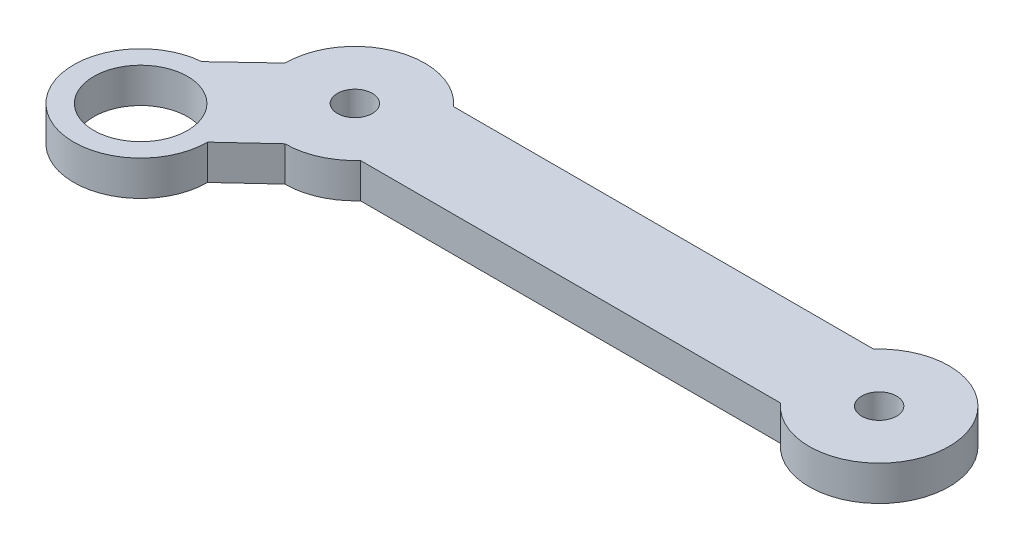
ISO-10303-21;
HEADER;
FILE_DESCRIPTION(('STEP AP214'),'2;1');
FILE_NAME('part.step','',(''),(''),'','','');
FILE_SCHEMA(('AUTOMOTIVE_DESIGN { 1 0 10303 214 1 1 1 1 }'));
ENDSEC;
DATA;
#1=APPLICATION_CONTEXT('core data for automotive mechanical design processes');
#2=APPLICATION_PROTOCOL_DEFINITION('international standard','automotive_design',2000,#1);
#3=PRODUCT_CONTEXT('',#1,'mechanical');
#4=PRODUCT('Part','Part','',(#3));
#5=PRODUCT_RELATED_PRODUCT_CATEGORY('part','',(#4));
#6=PRODUCT_DEFINITION_FORMATION('','',#4);
#7=PRODUCT_DEFINITION_CONTEXT('part definition',#1,'design');
#8=PRODUCT_DEFINITION('design','',#6,#7);
#9=PRODUCT_DEFINITION_SHAPE('','',#8);
#10=(LENGTH_UNIT() NAMED_UNIT(*) SI_UNIT(.MILLI.,.METRE.));
#11=(NAMED_UNIT(*) PLANE_ANGLE_UNIT() SI_UNIT($,.RADIAN.));
#12=(NAMED_UNIT(*) SI_UNIT($,.STERADIAN.) SOLID_ANGLE_UNIT());
#13=UNCERTAINTY_MEASURE_WITH_UNIT(LENGTH_MEASURE(1.E-05),#10,'distance_accuracy_value','');
#14=(GEOMETRIC_REPRESENTATION_CONTEXT(3) GLOBAL_UNCERTAINTY_ASSIGNED_CONTEXT((#13)) GLOBAL_UNIT_ASSIGNED_CONTEXT((#10,
#11,#12)) REPRESENTATION_CONTEXT('',''));
#15=CARTESIAN_POINT('',(0.,0.,0.));
#16=DIRECTION('',(0.,0.,1.));
#17=DIRECTION('',(1.,0.,0.));
#18=AXIS2_PLACEMENT_3D('',#15,#16,#17);
#19=CARTESIAN_POINT('',(-23.9679992587768,3.,-25.45393827542));
#20=DIRECTION('',(-0.685536847864458,0.,-0.728037931855245));
#21=DIRECTION('',(-0.728037931855245,0.,0.685536847864458));
#22=AXIS2_PLACEMENT_3D('',#19,#20,#21);
#23=PLANE('',#22);
#24=DIRECTION('',(0.728037931855245,0.,-0.685536847864458));
#25=VECTOR('',#24,1.);
#26=CARTESIAN_POINT('',(-23.9679992587768,0.,-25.45393827542));
#27=LINE('',#26,#25);
#28=CARTESIAN_POINT('',(-54.6775840073379,0.,3.46289559628114));
#29=VERTEX_POINT('',#28);
#30=CARTESIAN_POINT('',(-51.,0.,0.));
#31=VERTEX_POINT('',#30);
#32=EDGE_CURVE('E138',#29,#31,#27,.T.);
#33=ORIENTED_EDGE('',*,*,#32,.F.);
#34=DIRECTION('',(0.,-1.,0.));
#35=VECTOR('',#34,1.);
#36=CARTESIAN_POINT('',(-54.6775840073379,3.,3.46289559628114));
#37=LINE('',#36,#35);
#38=CARTESIAN_POINT('',(-54.6775840073379,3.,3.46289559628114));
#39=VERTEX_POINT('',#38);
#40=EDGE_CURVE('E11',#39,#29,#37,.T.);
#41=ORIENTED_EDGE('',*,*,#40,.F.);
#42=DIRECTION('',(0.728037931855245,0.,-0.685536847864458));
#43=VECTOR('',#42,1.);
#44=CARTESIAN_POINT('',(-23.9679992587768,3.,-25.45393827542));
#45=LINE('',#44,#43);
#46=CARTESIAN_POINT('',(-51.,3.,0.));
#47=VERTEX_POINT('',#46);
#48=EDGE_CURVE('E162',#39,#47,#45,.T.);
#49=ORIENTED_EDGE('',*,*,#48,.T.);
#50=DIRECTION('',(0.,-1.,0.));
#51=VECTOR('',#50,1.);
#52=CARTESIAN_POINT('',(-51.,3.,0.));
#53=LINE('',#52,#51);
#54=EDGE_CURVE('E83',#47,#31,#53,.T.);
#55=ORIENTED_EDGE('',*,*,#54,.T.);
#56=EDGE_LOOP('',(#33,#41,#49,#55));
#57=FACE_BOUND('',#56,.T.);
#58=ADVANCED_FACE('F33',(#57),#23,.T.);
#59=CARTESIAN_POINT('',(-54.1923881554251,3.,9.19238815542514));
#60=DIRECTION('',(0.,-1.,0.));
#61=DIRECTION('',(0.,0.,-1.));
#62=AXIS2_PLACEMENT_3D('',#59,#60,#61);
#63=CYLINDRICAL_SURFACE('',#62,5.75);
#64=CARTESIAN_POINT('',(-54.1923881554251,0.,9.19238815542514));
#65=DIRECTION('',(0.,1.,0.));
#66=DIRECTION('',(0.,0.,1.));
#67=AXIS2_PLACEMENT_3D('',#64,#65,#66);
#68=CIRCLE('',#67,5.75);
#69=CARTESIAN_POINT('',(-48.4423881554251,0.,9.19238815542515));
#70=VERTEX_POINT('',#69);
#71=EDGE_CURVE('E141',#29,#70,#68,.T.);
#72=ORIENTED_EDGE('',*,*,#71,.T.);
#73=DIRECTION('',(0.,-1.,0.));
#74=VECTOR('',#73,1.);
#75=CARTESIAN_POINT('',(-48.4423881554251,3.,9.19238815542515));
#76=LINE('',#75,#74);
#77=CARTESIAN_POINT('',(-48.4423881554251,3.,9.19238815542515));
#78=VERTEX_POINT('',#77);
#79=EDGE_CURVE('E41',#78,#70,#76,.T.);
#80=ORIENTED_EDGE('',*,*,#79,.F.);
#81=CARTESIAN_POINT('',(-54.1923881554251,3.,9.19238815542514));
#82=DIRECTION('',(0.,1.,0.));
#83=DIRECTION('',(0.,0.,1.));
#84=AXIS2_PLACEMENT_3D('',#81,#82,#83);
#85=CIRCLE('',#84,5.75);
#86=EDGE_CURVE('E194',#39,#78,#85,.T.);
#87=ORIENTED_EDGE('',*,*,#86,.F.);
#88=ORIENTED_EDGE('',*,*,#40,.T.);
#89=EDGE_LOOP('',(#72,#80,#87,#88));
#90=FACE_BOUND('',#89,.T.);
#91=ADVANCED_FACE('F196',(#90),#63,.T.);
#92=CARTESIAN_POINT('',(-17.8152996984545,3.,-19.2104386063108));
#93=DIRECTION('',(-0.679980277016653,0.,-0.73323040230773));
#94=DIRECTION('',(-0.73323040230773,0.,0.679980277016653));
#95=AXIS2_PLACEMENT_3D('',#92,#93,#94);
#96=PLANE('',#95);
#97=DIRECTION('',(0.73323040230773,0.,-0.679980277016653));
#98=VECTOR('',#97,1.);
#99=CARTESIAN_POINT('',(-17.8152996984545,0.,-19.2104386063108));
#100=LINE('',#99,#98);
#101=CARTESIAN_POINT('',(-45.,0.,6.00000000000001));
#102=VERTEX_POINT('',#101);
#103=EDGE_CURVE('E143',#70,#102,#100,.T.);
#104=ORIENTED_EDGE('',*,*,#103,.T.);
#105=DIRECTION('',(0.,-1.,0.));
#106=VECTOR('',#105,1.);
#107=CARTESIAN_POINT('',(-45.,3.,6.00000000000001));
#108=LINE('',#107,#106);
#109=CARTESIAN_POINT('',(-45.,3.,6.00000000000001));
#110=VERTEX_POINT('',#109);
#111=EDGE_CURVE('E169',#110,#102,#108,.T.);
#112=ORIENTED_EDGE('',*,*,#111,.F.);
#113=DIRECTION('',(0.73323040230773,0.,-0.679980277016653));
#114=VECTOR('',#113,1.);
#115=CARTESIAN_POINT('',(-17.8152996984545,3.,-19.2104386063108));
#116=LINE('',#115,#114);
#117=EDGE_CURVE('E178',#78,#110,#116,.T.);
#118=ORIENTED_EDGE('',*,*,#117,.F.);
#119=ORIENTED_EDGE('',*,*,#79,.T.);
#120=EDGE_LOOP('',(#104,#112,#118,#119));
#121=FACE_BOUND('',#120,.T.);
#122=ADVANCED_FACE('F176',(#121),#96,.F.);
#123=CARTESIAN_POINT('',(-45.,3.,0.));
#124=DIRECTION('',(0.,-1.,0.));
#125=DIRECTION('',(0.,0.,-1.));
#126=AXIS2_PLACEMENT_3D('',#123,#124,#125);
#127=CYLINDRICAL_SURFACE('',#126,6.);
#128=CARTESIAN_POINT('',(-45.,0.,0.));
#129=DIRECTION('',(0.,1.,0.));
#130=DIRECTION('',(0.,0.,1.));
#131=AXIS2_PLACEMENT_3D('',#128,#129,#130);
#132=CIRCLE('',#131,6.);
#133=CARTESIAN_POINT('',(-40.5278640450004,0.,4.00000000000001));
#134=VERTEX_POINT('',#133);
#135=EDGE_CURVE('E145',#102,#134,#132,.T.);
#136=ORIENTED_EDGE('',*,*,#135,.T.);
#137=DIRECTION('',(0.,-1.,0.));
#138=VECTOR('',#137,1.);
#139=CARTESIAN_POINT('',(-40.5278640450004,3.,4.00000000000001));
#140=LINE('',#139,#138);
#141=CARTESIAN_POINT('',(-40.5278640450004,3.,4.00000000000001));
#142=VERTEX_POINT('',#141);
#143=EDGE_CURVE('E166',#142,#134,#140,.T.);
#144=ORIENTED_EDGE('',*,*,#143,.F.);
#145=CARTESIAN_POINT('',(-45.,3.,0.));
#146=DIRECTION('',(0.,1.,0.));
#147=DIRECTION('',(0.,0.,1.));
#148=AXIS2_PLACEMENT_3D('',#145,#146,#147);
#149=CIRCLE('',#148,6.);
#150=EDGE_CURVE('E127',#110,#142,#149,.T.);
#151=ORIENTED_EDGE('',*,*,#150,.F.);
#152=ORIENTED_EDGE('',*,*,#111,.T.);
#153=EDGE_LOOP('',(#136,#144,#151,#152));
#154=FACE_BOUND('',#153,.T.);
#155=ADVANCED_FACE('F188',(#154),#127,.T.);
#156=CARTESIAN_POINT('',(0.,3.,4.00000000000001));
#157=DIRECTION('',(0.,0.,-1.));
#158=DIRECTION('',(-1.,0.,0.));
#159=AXIS2_PLACEMENT_3D('',#156,#157,#158);
#160=PLANE('',#159);
#161=DIRECTION('',(1.,0.,0.));
#162=VECTOR('',#161,1.);
#163=CARTESIAN_POINT('',(0.,0.,4.00000000000001));
#164=LINE('',#163,#162);
#165=CARTESIAN_POINT('',(-4.47213595499958,0.,4.00000000000001));
#166=VERTEX_POINT('',#165);
#167=EDGE_CURVE('E147',#134,#166,#164,.T.);
#168=ORIENTED_EDGE('',*,*,#167,.T.);
#169=DIRECTION('',(0.,-1.,0.));
#170=VECTOR('',#169,1.);
#171=CARTESIAN_POINT('',(-4.47213595499958,3.,4.00000000000001));
#172=LINE('',#171,#170);
#173=CARTESIAN_POINT('',(-4.47213595499958,3.,4.00000000000001));
#174=VERTEX_POINT('',#173);
#175=EDGE_CURVE('E121',#174,#166,#172,.T.);
#176=ORIENTED_EDGE('',*,*,#175,.F.);
#177=DIRECTION('',(1.,0.,0.));
#178=VECTOR('',#177,1.);
#179=CARTESIAN_POINT('',(0.,3.,4.00000000000001));
#180=LINE('',#179,#178);
#181=EDGE_CURVE('E108',#142,#174,#180,.T.);
#182=ORIENTED_EDGE('',*,*,#181,.F.);
#183=ORIENTED_EDGE('',*,*,#143,.T.);
#184=EDGE_LOOP('',(#168,#176,#182,#183));
#185=FACE_BOUND('',#184,.T.);
#186=ADVANCED_FACE('F191',(#185),#160,.F.);
#187=CARTESIAN_POINT('',(0.,3.,0.));
#188=DIRECTION('',(0.,-1.,0.));
#189=DIRECTION('',(0.,0.,-1.));
#190=AXIS2_PLACEMENT_3D('',#187,#188,#189);
#191=CYLINDRICAL_SURFACE('',#190,6.);
#192=CARTESIAN_POINT('',(0.,0.,0.));
#193=DIRECTION('',(0.,1.,0.));
#194=DIRECTION('',(0.,0.,1.));
#195=AXIS2_PLACEMENT_3D('',#192,#193,#194);
#196=CIRCLE('',#195,6.);
#197=CARTESIAN_POINT('',(-4.47213595499958,0.,-4.));
#198=VERTEX_POINT('',#197);
#199=EDGE_CURVE('E117',#166,#198,#196,.T.);
#200=ORIENTED_EDGE('',*,*,#199,.T.);
#201=DIRECTION('',(0.,-1.,0.));
#202=VECTOR('',#201,1.);
#203=CARTESIAN_POINT('',(-4.47213595499958,3.,-4.));
#204=LINE('',#203,#202);
#205=CARTESIAN_POINT('',(-4.47213595499958,3.,-4.));
#206=VERTEX_POINT('',#205);
#207=EDGE_CURVE('E114',#206,#198,#204,.T.);
#208=ORIENTED_EDGE('',*,*,#207,.F.);
#209=CARTESIAN_POINT('',(0.,3.,0.));
#210=DIRECTION('',(0.,1.,0.));
#211=DIRECTION('',(0.,0.,1.));
#212=AXIS2_PLACEMENT_3D('',#209,#210,#211);
#213=CIRCLE('',#212,6.);
#214=EDGE_CURVE('E101',#174,#206,#213,.T.);
#215=ORIENTED_EDGE('',*,*,#214,.F.);
#216=ORIENTED_EDGE('',*,*,#175,.T.);
#217=EDGE_LOOP('',(#200,#208,#215,#216));
#218=FACE_BOUND('',#217,.T.);
#219=ADVANCED_FACE('F115',(#218),#191,.T.);
#220=CARTESIAN_POINT('',(0.,3.,-4.));
#221=DIRECTION('',(0.,0.,-1.));
#222=DIRECTION('',(-1.,0.,0.));
#223=AXIS2_PLACEMENT_3D('',#220,#221,#222);
#224=PLANE('',#223);
#225=DIRECTION('',(1.,0.,0.));
#226=VECTOR('',#225,1.);
#227=CARTESIAN_POINT('',(0.,0.,-4.));
#228=LINE('',#227,#226);
#229=CARTESIAN_POINT('',(-40.5278640450004,0.,-4.));
#230=VERTEX_POINT('',#229);
#231=EDGE_CURVE('E151',#230,#198,#228,.T.);
#232=ORIENTED_EDGE('',*,*,#231,.F.);
#233=DIRECTION('',(0.,-1.,0.));
#234=VECTOR('',#233,1.);
#235=CARTESIAN_POINT('',(-40.5278640450004,3.,-4.));
#236=LINE('',#235,#234);
#237=CARTESIAN_POINT('',(-40.5278640450004,3.,-4.));
#238=VERTEX_POINT('',#237);
#239=EDGE_CURVE('E76',#238,#230,#236,.T.);
#240=ORIENTED_EDGE('',*,*,#239,.F.);
#241=DIRECTION('',(1.,0.,0.));
#242=VECTOR('',#241,1.);
#243=CARTESIAN_POINT('',(0.,3.,-4.));
#244=LINE('',#243,#242);
#245=EDGE_CURVE('E106',#238,#206,#244,.T.);
#246=ORIENTED_EDGE('',*,*,#245,.T.);
#247=ORIENTED_EDGE('',*,*,#207,.T.);
#248=EDGE_LOOP('',(#232,#240,#246,#247));
#249=FACE_BOUND('',#248,.T.);
#250=ADVANCED_FACE('F123',(#249),#224,.T.);
#251=CARTESIAN_POINT('',(-45.,3.,0.));
#252=DIRECTION('',(0.,-1.,0.));
#253=DIRECTION('',(0.,0.,-1.));
#254=AXIS2_PLACEMENT_3D('',#251,#252,#253);
#255=CYLINDRICAL_SURFACE('',#254,1.5);
#256=CARTESIAN_POINT('',(-45.,3.,0.));
#257=DIRECTION('',(0.,1.,0.));
#258=DIRECTION('',(0.,0.,1.));
#259=AXIS2_PLACEMENT_3D('',#256,#257,#258);
#260=CIRCLE('',#259,1.5);
#261=CARTESIAN_POINT('',(-45.,3.,1.50000000000001));
#262=VERTEX_POINT('',#261);
#263=EDGE_CURVE('E132',#262,#262,#260,.T.);
#264=ORIENTED_EDGE('',*,*,#263,.T.);
#265=EDGE_LOOP('',(#264));
#266=FACE_BOUND('',#265,.T.);
#267=CARTESIAN_POINT('',(-45.,0.,0.));
#268=DIRECTION('',(0.,1.,0.));
#269=DIRECTION('',(0.,0.,1.));
#270=AXIS2_PLACEMENT_3D('',#267,#268,#269);
#271=CIRCLE('',#270,1.5);
#272=CARTESIAN_POINT('',(-45.,0.,1.50000000000001));
#273=VERTEX_POINT('',#272);
#274=EDGE_CURVE('E156',#273,#273,#271,.T.);
#275=ORIENTED_EDGE('',*,*,#274,.F.);
#276=EDGE_LOOP('',(#275));
#277=FACE_BOUND('',#276,.T.);
#278=ADVANCED_FACE('F210',(#266,#277),#255,.F.);
#279=CARTESIAN_POINT('',(0.,3.,0.));
#280=DIRECTION('',(0.,-1.,0.));
#281=DIRECTION('',(0.,0.,-1.));
#282=AXIS2_PLACEMENT_3D('',#279,#280,#281);
#283=CYLINDRICAL_SURFACE('',#282,1.5);
#284=CARTESIAN_POINT('',(0.,3.,0.));
#285=DIRECTION('',(0.,1.,0.));
#286=DIRECTION('',(0.,0.,1.));
#287=AXIS2_PLACEMENT_3D('',#284,#285,#286);
#288=CIRCLE('',#287,1.5);
#289=CARTESIAN_POINT('',(0.,3.,1.5));
#290=VERTEX_POINT('',#289);
#291=EDGE_CURVE('E125',#290,#290,#288,.T.);
#292=ORIENTED_EDGE('',*,*,#291,.T.);
#293=EDGE_LOOP('',(#292));
#294=FACE_BOUND('',#293,.T.);
#295=CARTESIAN_POINT('',(0.,0.,0.));
#296=DIRECTION('',(0.,1.,0.));
#297=DIRECTION('',(0.,0.,1.));
#298=AXIS2_PLACEMENT_3D('',#295,#296,#297);
#299=CIRCLE('',#298,1.5);
#300=CARTESIAN_POINT('',(0.,0.,1.5));
#301=VERTEX_POINT('',#300);
#302=EDGE_CURVE('E153',#301,#301,#299,.T.);
#303=ORIENTED_EDGE('',*,*,#302,.F.);
#304=EDGE_LOOP('',(#303));
#305=FACE_BOUND('',#304,.T.);
#306=ADVANCED_FACE('F215',(#294,#305),#283,.F.);
#307=EDGE_CURVE('E148',#230,#31,#132,.T.);
#308=ORIENTED_EDGE('',*,*,#307,.T.);
#309=ORIENTED_EDGE('',*,*,#54,.F.);
#310=EDGE_CURVE('E49',#238,#47,#149,.T.);
#311=ORIENTED_EDGE('',*,*,#310,.F.);
#312=ORIENTED_EDGE('',*,*,#239,.T.);
#313=EDGE_LOOP('',(#308,#309,#311,#312));
#314=FACE_BOUND('',#313,.T.);
#315=ADVANCED_FACE('F211',(#314),#127,.T.);
#316=CARTESIAN_POINT('',(-54.1923881554251,3.,9.19238815542514));
#317=DIRECTION('',(0.,-1.,0.));
#318=DIRECTION('',(0.,0.,-1.));
#319=AXIS2_PLACEMENT_3D('',#316,#317,#318);
#320=CYLINDRICAL_SURFACE('',#319,4.024);
#321=CARTESIAN_POINT('',(-54.1923881554251,3.,9.19238815542514));
#322=DIRECTION('',(0.,1.,0.));
#323=DIRECTION('',(0.,0.,1.));
#324=AXIS2_PLACEMENT_3D('',#321,#322,#323);
#325=CIRCLE('',#324,4.024);
#326=CARTESIAN_POINT('',(-54.1923881554251,3.,13.2163881554251));
#327=VERTEX_POINT('',#326);
#328=EDGE_CURVE('E135',#327,#327,#325,.T.);
#329=ORIENTED_EDGE('',*,*,#328,.T.);
#330=EDGE_LOOP('',(#329));
#331=FACE_BOUND('',#330,.T.);
#332=CARTESIAN_POINT('',(-54.1923881554251,0.,9.19238815542514));
#333=DIRECTION('',(0.,1.,0.));
#334=DIRECTION('',(0.,0.,1.));
#335=AXIS2_PLACEMENT_3D('',#332,#333,#334);
#336=CIRCLE('',#335,4.024);
#337=CARTESIAN_POINT('',(-54.1923881554251,0.,13.2163881554251));
#338=VERTEX_POINT('',#337);
#339=EDGE_CURVE('E159',#338,#338,#336,.T.);
#340=ORIENTED_EDGE('',*,*,#339,.F.);
#341=EDGE_LOOP('',(#340));
#342=FACE_BOUND('',#341,.T.);
#343=ADVANCED_FACE('F214',(#331,#342),#320,.F.);
#344=CARTESIAN_POINT('',(0.,3.,0.));
#345=DIRECTION('',(0.,1.,0.));
#346=DIRECTION('',(0.,0.,1.));
#347=AXIS2_PLACEMENT_3D('',#344,#345,#346);
#348=PLANE('',#347);
#349=ORIENTED_EDGE('',*,*,#48,.F.);
#350=ORIENTED_EDGE('',*,*,#86,.T.);
#351=ORIENTED_EDGE('',*,*,#117,.T.);
#352=ORIENTED_EDGE('',*,*,#150,.T.);
#353=ORIENTED_EDGE('',*,*,#181,.T.);
#354=ORIENTED_EDGE('',*,*,#214,.T.);
#355=ORIENTED_EDGE('',*,*,#245,.F.);
#356=ORIENTED_EDGE('',*,*,#310,.T.);
#357=EDGE_LOOP('',(#349,#350,#351,#352,#353,#354,#355,#356));
#358=FACE_BOUND('',#357,.T.);
#359=ORIENTED_EDGE('',*,*,#291,.F.);
#360=EDGE_LOOP('',(#359));
#361=FACE_BOUND('',#360,.T.);
#362=ORIENTED_EDGE('',*,*,#263,.F.);
#363=EDGE_LOOP('',(#362));
#364=FACE_BOUND('',#363,.T.);
#365=ORIENTED_EDGE('',*,*,#328,.F.);
#366=EDGE_LOOP('',(#365));
#367=FACE_BOUND('',#366,.T.);
#368=ADVANCED_FACE('F103',(#358,#361,#364,#367),#348,.T.);
#369=CARTESIAN_POINT('',(0.,0.,0.));
#370=DIRECTION('',(0.,1.,0.));
#371=DIRECTION('',(0.,0.,1.));
#372=AXIS2_PLACEMENT_3D('',#369,#370,#371);
#373=PLANE('',#372);
#374=ORIENTED_EDGE('',*,*,#32,.T.);
#375=ORIENTED_EDGE('',*,*,#307,.F.);
#376=ORIENTED_EDGE('',*,*,#231,.T.);
#377=ORIENTED_EDGE('',*,*,#199,.F.);
#378=ORIENTED_EDGE('',*,*,#167,.F.);
#379=ORIENTED_EDGE('',*,*,#135,.F.);
#380=ORIENTED_EDGE('',*,*,#103,.F.);
#381=ORIENTED_EDGE('',*,*,#71,.F.);
#382=EDGE_LOOP('',(#374,#375,#376,#377,#378,#379,#380,#381));
#383=FACE_BOUND('',#382,.T.);
#384=ORIENTED_EDGE('',*,*,#302,.T.);
#385=EDGE_LOOP('',(#384));
#386=FACE_BOUND('',#385,.T.);
#387=ORIENTED_EDGE('',*,*,#274,.T.);
#388=EDGE_LOOP('',(#387));
#389=FACE_BOUND('',#388,.T.);
#390=ORIENTED_EDGE('',*,*,#339,.T.);
#391=EDGE_LOOP('',(#390));
#392=FACE_BOUND('',#391,.T.);
#393=ADVANCED_FACE('F183',(#383,#386,#389,#392),#373,.F.);
#394=CLOSED_SHELL('',(#58,#91,#122,#155,#186,#219,#250,#278,#306,#315,#343,#368,#393));
#395=MANIFOLD_SOLID_BREP('B2',#394);
#396=ADVANCED_BREP_SHAPE_REPRESENTATION('',(#18,#395),#14);
#397=SHAPE_DEFINITION_REPRESENTATION(#9,#396);
ENDSEC;
END-ISO-10303-21;
